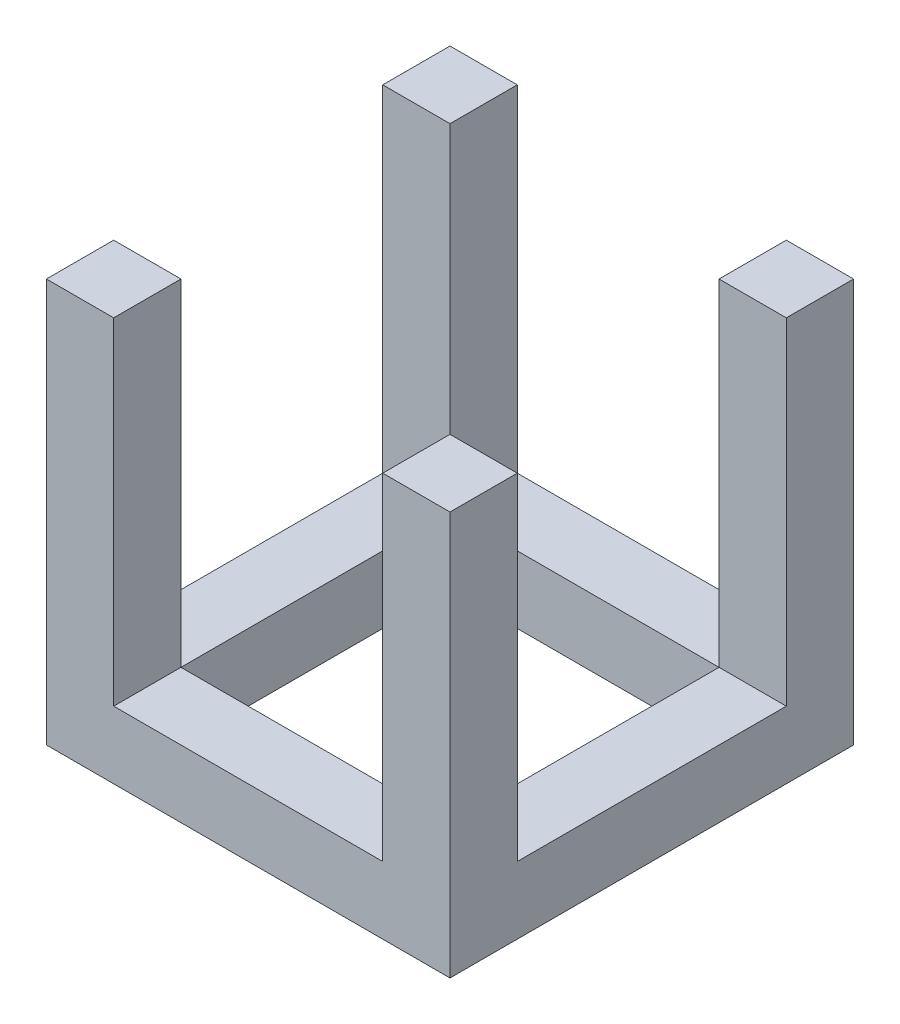
ISO-10303-21;
HEADER;
FILE_DESCRIPTION(('STEP AP214'),'2;1');
FILE_NAME('part.step','',(''),(''),'','','');
FILE_SCHEMA(('AUTOMOTIVE_DESIGN { 1 0 10303 214 1 1 1 1 }'));
ENDSEC;
DATA;
#1=APPLICATION_CONTEXT('core data for automotive mechanical design processes');
#2=APPLICATION_PROTOCOL_DEFINITION('international standard','automotive_design',2000,#1);
#3=PRODUCT_CONTEXT('',#1,'mechanical');
#4=PRODUCT('Part','Part','',(#3));
#5=PRODUCT_RELATED_PRODUCT_CATEGORY('part','',(#4));
#6=PRODUCT_DEFINITION_FORMATION('','',#4);
#7=PRODUCT_DEFINITION_CONTEXT('part definition',#1,'design');
#8=PRODUCT_DEFINITION('design','',#6,#7);
#9=PRODUCT_DEFINITION_SHAPE('','',#8);
#10=(LENGTH_UNIT() NAMED_UNIT(*) SI_UNIT(.MILLI.,.METRE.));
#11=(NAMED_UNIT(*) PLANE_ANGLE_UNIT() SI_UNIT($,.RADIAN.));
#12=(NAMED_UNIT(*) SI_UNIT($,.STERADIAN.) SOLID_ANGLE_UNIT());
#13=UNCERTAINTY_MEASURE_WITH_UNIT(LENGTH_MEASURE(1.E-05),#10,'distance_accuracy_value','');
#14=(GEOMETRIC_REPRESENTATION_CONTEXT(3) GLOBAL_UNCERTAINTY_ASSIGNED_CONTEXT((#13)) GLOBAL_UNIT_ASSIGNED_CONTEXT((#10,
#11,#12)) REPRESENTATION_CONTEXT('',''));
#15=CARTESIAN_POINT('',(0.,0.,0.));
#16=DIRECTION('',(0.,0.,1.));
#17=DIRECTION('',(1.,0.,0.));
#18=AXIS2_PLACEMENT_3D('',#15,#16,#17);
#19=CARTESIAN_POINT('',(0.,30.,0.));
#20=DIRECTION('',(0.,-1.,0.));
#21=DIRECTION('',(0.,0.,-1.));
#22=AXIS2_PLACEMENT_3D('',#19,#20,#21);
#23=PLANE('',#22);
#24=DIRECTION('',(0.,0.,-1.));
#25=VECTOR('',#24,1.);
#26=CARTESIAN_POINT('',(15.,30.,15.));
#27=LINE('',#26,#25);
#28=CARTESIAN_POINT('',(15.,30.,15.));
#29=VERTEX_POINT('',#28);
#30=CARTESIAN_POINT('',(15.,30.,9.99999999999999));
#31=VERTEX_POINT('',#30);
#32=EDGE_CURVE('E188',#29,#31,#27,.T.);
#33=ORIENTED_EDGE('',*,*,#32,.T.);
#34=DIRECTION('',(-1.,0.,0.));
#35=VECTOR('',#34,1.);
#36=CARTESIAN_POINT('',(15.,30.,9.99999999999999));
#37=LINE('',#36,#35);
#38=CARTESIAN_POINT('',(10.,30.,9.99999999999999));
#39=VERTEX_POINT('',#38);
#40=EDGE_CURVE('E265',#31,#39,#37,.T.);
#41=ORIENTED_EDGE('',*,*,#40,.T.);
#42=DIRECTION('',(0.,0.,-1.));
#43=VECTOR('',#42,1.);
#44=CARTESIAN_POINT('',(10.,30.,10.));
#45=LINE('',#44,#43);
#46=CARTESIAN_POINT('',(10.,30.,15.));
#47=VERTEX_POINT('',#46);
#48=EDGE_CURVE('E312',#47,#39,#45,.T.);
#49=ORIENTED_EDGE('',*,*,#48,.F.);
#50=DIRECTION('',(1.,0.,0.));
#51=VECTOR('',#50,1.);
#52=CARTESIAN_POINT('',(-15.,30.,15.));
#53=LINE('',#52,#51);
#54=EDGE_CURVE('E205',#47,#29,#53,.T.);
#55=ORIENTED_EDGE('',*,*,#54,.T.);
#56=EDGE_LOOP('',(#33,#41,#49,#55));
#57=FACE_BOUND('',#56,.T.);
#58=ADVANCED_FACE('F39',(#57),#23,.F.);
#59=DIRECTION('',(0.,0.,1.));
#60=VECTOR('',#59,1.);
#61=CARTESIAN_POINT('',(-10.,30.,10.));
#62=LINE('',#61,#60);
#63=CARTESIAN_POINT('',(-10.,30.,10.));
#64=VERTEX_POINT('',#63);
#65=CARTESIAN_POINT('',(-10.,30.,15.));
#66=VERTEX_POINT('',#65);
#67=EDGE_CURVE('E252',#64,#66,#62,.T.);
#68=ORIENTED_EDGE('',*,*,#67,.F.);
#69=CARTESIAN_POINT('',(-15.,30.,10.));
#70=VERTEX_POINT('',#69);
#71=EDGE_CURVE('E253',#64,#70,#37,.T.);
#72=ORIENTED_EDGE('',*,*,#71,.T.);
#73=DIRECTION('',(0.,0.,1.));
#74=VECTOR('',#73,1.);
#75=CARTESIAN_POINT('',(-15.,30.,15.));
#76=LINE('',#75,#74);
#77=CARTESIAN_POINT('',(-15.,30.,15.));
#78=VERTEX_POINT('',#77);
#79=EDGE_CURVE('E201',#70,#78,#76,.T.);
#80=ORIENTED_EDGE('',*,*,#79,.T.);
#81=EDGE_CURVE('E206',#78,#66,#53,.T.);
#82=ORIENTED_EDGE('',*,*,#81,.T.);
#83=EDGE_LOOP('',(#68,#72,#80,#82));
#84=FACE_BOUND('',#83,.T.);
#85=ADVANCED_FACE('F250',(#84),#23,.F.);
#86=CARTESIAN_POINT('',(10.,30.,10.));
#87=DIRECTION('',(-1.,0.,0.));
#88=DIRECTION('',(0.,0.,1.));
#89=AXIS2_PLACEMENT_3D('',#86,#87,#88);
#90=PLANE('',#89);
#91=DIRECTION('',(0.,1.,0.));
#92=VECTOR('',#91,1.);
#93=CARTESIAN_POINT('',(10.,30.,9.99999999999999));
#94=LINE('',#93,#92);
#95=CARTESIAN_POINT('',(10.,5.00000000000001,9.99999999999999));
#96=VERTEX_POINT('',#95);
#97=EDGE_CURVE('E279',#96,#39,#94,.T.);
#98=ORIENTED_EDGE('',*,*,#97,.F.);
#99=DIRECTION('',(0.,0.,1.));
#100=VECTOR('',#99,1.);
#101=CARTESIAN_POINT('',(10.,5.00000000000001,-15.));
#102=LINE('',#101,#100);
#103=CARTESIAN_POINT('',(10.,5.00000000000001,15.));
#104=VERTEX_POINT('',#103);
#105=EDGE_CURVE('E305',#96,#104,#102,.T.);
#106=ORIENTED_EDGE('',*,*,#105,.T.);
#107=DIRECTION('',(0.,1.,0.));
#108=VECTOR('',#107,1.);
#109=CARTESIAN_POINT('',(10.,30.,15.));
#110=LINE('',#109,#108);
#111=EDGE_CURVE('E290',#104,#47,#110,.T.);
#112=ORIENTED_EDGE('',*,*,#111,.T.);
#113=ORIENTED_EDGE('',*,*,#48,.T.);
#114=EDGE_LOOP('',(#98,#106,#112,#113));
#115=FACE_BOUND('',#114,.T.);
#116=ADVANCED_FACE('F360',(#115),#90,.T.);
#117=DIRECTION('',(0.,0.,1.));
#118=VECTOR('',#117,1.);
#119=CARTESIAN_POINT('',(10.,5.00000000000001,10.));
#120=LINE('',#119,#118);
#121=CARTESIAN_POINT('',(10.,5.,-10.));
#122=VERTEX_POINT('',#121);
#123=EDGE_CURVE('E284',#122,#96,#120,.T.);
#124=ORIENTED_EDGE('',*,*,#123,.F.);
#125=DIRECTION('',(0.,-1.,0.));
#126=VECTOR('',#125,1.);
#127=CARTESIAN_POINT('',(10.,30.,-10.));
#128=LINE('',#127,#126);
#129=CARTESIAN_POINT('',(10.,0.,-10.));
#130=VERTEX_POINT('',#129);
#131=EDGE_CURVE('E197',#122,#130,#128,.T.);
#132=ORIENTED_EDGE('',*,*,#131,.T.);
#133=DIRECTION('',(0.,0.,-1.));
#134=VECTOR('',#133,1.);
#135=CARTESIAN_POINT('',(10.,0.,10.));
#136=LINE('',#135,#134);
#137=CARTESIAN_POINT('',(10.,0.,10.));
#138=VERTEX_POINT('',#137);
#139=EDGE_CURVE('E311',#138,#130,#136,.T.);
#140=ORIENTED_EDGE('',*,*,#139,.F.);
#141=DIRECTION('',(0.,-1.,0.));
#142=VECTOR('',#141,1.);
#143=CARTESIAN_POINT('',(10.,30.,10.));
#144=LINE('',#143,#142);
#145=EDGE_CURVE('E62',#96,#138,#144,.T.);
#146=ORIENTED_EDGE('',*,*,#145,.F.);
#147=EDGE_LOOP('',(#124,#132,#140,#146));
#148=FACE_BOUND('',#147,.T.);
#149=ADVANCED_FACE('F340',(#148),#90,.T.);
#150=CARTESIAN_POINT('',(-10.,30.,10.));
#151=DIRECTION('',(1.,0.,0.));
#152=DIRECTION('',(0.,0.,-1.));
#153=AXIS2_PLACEMENT_3D('',#150,#151,#152);
#154=PLANE('',#153);
#155=DIRECTION('',(0.,-1.,0.));
#156=VECTOR('',#155,1.);
#157=CARTESIAN_POINT('',(-10.,30.,10.));
#158=LINE('',#157,#156);
#159=CARTESIAN_POINT('',(-10.,5.00000000000001,10.));
#160=VERTEX_POINT('',#159);
#161=EDGE_CURVE('E277',#64,#160,#158,.T.);
#162=ORIENTED_EDGE('',*,*,#161,.F.);
#163=ORIENTED_EDGE('',*,*,#67,.T.);
#164=DIRECTION('',(0.,-1.,0.));
#165=VECTOR('',#164,1.);
#166=CARTESIAN_POINT('',(-10.,30.,15.));
#167=LINE('',#166,#165);
#168=CARTESIAN_POINT('',(-10.,5.,15.));
#169=VERTEX_POINT('',#168);
#170=EDGE_CURVE('E247',#66,#169,#167,.T.);
#171=ORIENTED_EDGE('',*,*,#170,.T.);
#172=DIRECTION('',(0.,0.,1.));
#173=VECTOR('',#172,1.);
#174=CARTESIAN_POINT('',(-10.,5.,-15.));
#175=LINE('',#174,#173);
#176=EDGE_CURVE('E294',#160,#169,#175,.T.);
#177=ORIENTED_EDGE('',*,*,#176,.F.);
#178=EDGE_LOOP('',(#162,#163,#171,#177));
#179=FACE_BOUND('',#178,.T.);
#180=ADVANCED_FACE('F353',(#179),#154,.T.);
#181=DIRECTION('',(0.,0.,-1.));
#182=VECTOR('',#181,1.);
#183=CARTESIAN_POINT('',(-10.,5.00000000000001,10.));
#184=LINE('',#183,#182);
#185=CARTESIAN_POINT('',(-10.,5.,-10.));
#186=VERTEX_POINT('',#185);
#187=EDGE_CURVE('E281',#160,#186,#184,.T.);
#188=ORIENTED_EDGE('',*,*,#187,.F.);
#189=DIRECTION('',(0.,-1.,0.));
#190=VECTOR('',#189,1.);
#191=CARTESIAN_POINT('',(-10.,30.,10.));
#192=LINE('',#191,#190);
#193=CARTESIAN_POINT('',(-10.,0.,10.));
#194=VERTEX_POINT('',#193);
#195=EDGE_CURVE('E330',#160,#194,#192,.T.);
#196=ORIENTED_EDGE('',*,*,#195,.T.);
#197=DIRECTION('',(0.,0.,1.));
#198=VECTOR('',#197,1.);
#199=CARTESIAN_POINT('',(-10.,0.,10.));
#200=LINE('',#199,#198);
#201=CARTESIAN_POINT('',(-10.,0.,-10.));
#202=VERTEX_POINT('',#201);
#203=EDGE_CURVE('E323',#202,#194,#200,.T.);
#204=ORIENTED_EDGE('',*,*,#203,.F.);
#205=DIRECTION('',(0.,-1.,0.));
#206=VECTOR('',#205,1.);
#207=CARTESIAN_POINT('',(-10.,30.,-10.));
#208=LINE('',#207,#206);
#209=EDGE_CURVE('E331',#186,#202,#208,.T.);
#210=ORIENTED_EDGE('',*,*,#209,.F.);
#211=EDGE_LOOP('',(#188,#196,#204,#210));
#212=FACE_BOUND('',#211,.T.);
#213=ADVANCED_FACE('F346',(#212),#154,.T.);
#214=CARTESIAN_POINT('',(10.,30.,-10.));
#215=VERTEX_POINT('',#214);
#216=CARTESIAN_POINT('',(10.,30.,-15.));
#217=VERTEX_POINT('',#216);
#218=EDGE_CURVE('E181',#215,#217,#45,.T.);
#219=ORIENTED_EDGE('',*,*,#218,.F.);
#220=DIRECTION('',(-1.,0.,0.));
#221=VECTOR('',#220,1.);
#222=CARTESIAN_POINT('',(15.,30.,-10.));
#223=LINE('',#222,#221);
#224=CARTESIAN_POINT('',(15.,30.,-10.));
#225=VERTEX_POINT('',#224);
#226=EDGE_CURVE('E54',#225,#215,#223,.T.);
#227=ORIENTED_EDGE('',*,*,#226,.F.);
#228=CARTESIAN_POINT('',(15.,30.,-15.));
#229=VERTEX_POINT('',#228);
#230=EDGE_CURVE('E179',#225,#229,#27,.T.);
#231=ORIENTED_EDGE('',*,*,#230,.T.);
#232=DIRECTION('',(-1.,0.,0.));
#233=VECTOR('',#232,1.);
#234=CARTESIAN_POINT('',(-15.,30.,-15.));
#235=LINE('',#234,#233);
#236=EDGE_CURVE('E199',#229,#217,#235,.T.);
#237=ORIENTED_EDGE('',*,*,#236,.T.);
#238=EDGE_LOOP('',(#219,#227,#231,#237));
#239=FACE_BOUND('',#238,.T.);
#240=ADVANCED_FACE('F177',(#239),#23,.F.);
#241=CARTESIAN_POINT('',(-15.,30.,-15.));
#242=VERTEX_POINT('',#241);
#243=CARTESIAN_POINT('',(-15.,30.,-10.));
#244=VERTEX_POINT('',#243);
#245=EDGE_CURVE('E202',#242,#244,#76,.T.);
#246=ORIENTED_EDGE('',*,*,#245,.T.);
#247=CARTESIAN_POINT('',(-10.,30.,-10.));
#248=VERTEX_POINT('',#247);
#249=EDGE_CURVE('E183',#248,#244,#223,.T.);
#250=ORIENTED_EDGE('',*,*,#249,.F.);
#251=CARTESIAN_POINT('',(-10.,30.,-15.));
#252=VERTEX_POINT('',#251);
#253=EDGE_CURVE('E315',#252,#248,#62,.T.);
#254=ORIENTED_EDGE('',*,*,#253,.F.);
#255=EDGE_CURVE('E192',#252,#242,#235,.T.);
#256=ORIENTED_EDGE('',*,*,#255,.T.);
#257=EDGE_LOOP('',(#246,#250,#254,#256));
#258=FACE_BOUND('',#257,.T.);
#259=ADVANCED_FACE('F374',(#258),#23,.F.);
#260=CARTESIAN_POINT('',(0.,0.,0.));
#261=DIRECTION('',(0.,-1.,0.));
#262=DIRECTION('',(0.,0.,-1.));
#263=AXIS2_PLACEMENT_3D('',#260,#261,#262);
#264=PLANE('',#263);
#265=DIRECTION('',(0.,0.,-1.));
#266=VECTOR('',#265,1.);
#267=CARTESIAN_POINT('',(15.,0.,15.));
#268=LINE('',#267,#266);
#269=CARTESIAN_POINT('',(15.,0.,15.));
#270=VERTEX_POINT('',#269);
#271=CARTESIAN_POINT('',(15.,0.,-15.));
#272=VERTEX_POINT('',#271);
#273=EDGE_CURVE('E210',#270,#272,#268,.T.);
#274=ORIENTED_EDGE('',*,*,#273,.F.);
#275=DIRECTION('',(1.,0.,0.));
#276=VECTOR('',#275,1.);
#277=CARTESIAN_POINT('',(-15.,0.,15.));
#278=LINE('',#277,#276);
#279=CARTESIAN_POINT('',(-15.,0.,15.));
#280=VERTEX_POINT('',#279);
#281=EDGE_CURVE('E189',#280,#270,#278,.T.);
#282=ORIENTED_EDGE('',*,*,#281,.F.);
#283=DIRECTION('',(0.,0.,1.));
#284=VECTOR('',#283,1.);
#285=CARTESIAN_POINT('',(-15.,0.,15.));
#286=LINE('',#285,#284);
#287=CARTESIAN_POINT('',(-15.,0.,-15.));
#288=VERTEX_POINT('',#287);
#289=EDGE_CURVE('E193',#288,#280,#286,.T.);
#290=ORIENTED_EDGE('',*,*,#289,.F.);
#291=DIRECTION('',(-1.,0.,0.));
#292=VECTOR('',#291,1.);
#293=CARTESIAN_POINT('',(-15.,0.,-15.));
#294=LINE('',#293,#292);
#295=EDGE_CURVE('E212',#272,#288,#294,.T.);
#296=ORIENTED_EDGE('',*,*,#295,.F.);
#297=EDGE_LOOP('',(#274,#282,#290,#296));
#298=FACE_BOUND('',#297,.T.);
#299=DIRECTION('',(1.,0.,0.));
#300=VECTOR('',#299,1.);
#301=CARTESIAN_POINT('',(-10.,0.,10.));
#302=LINE('',#301,#300);
#303=EDGE_CURVE('E326',#194,#138,#302,.T.);
#304=ORIENTED_EDGE('',*,*,#303,.T.);
#305=ORIENTED_EDGE('',*,*,#139,.T.);
#306=DIRECTION('',(-1.,0.,0.));
#307=VECTOR('',#306,1.);
#308=CARTESIAN_POINT('',(-10.,0.,-10.));
#309=LINE('',#308,#307);
#310=EDGE_CURVE('E320',#130,#202,#309,.T.);
#311=ORIENTED_EDGE('',*,*,#310,.T.);
#312=ORIENTED_EDGE('',*,*,#203,.T.);
#313=EDGE_LOOP('',(#304,#305,#311,#312));
#314=FACE_BOUND('',#313,.T.);
#315=ADVANCED_FACE('F232',(#298,#314),#264,.T.);
#316=CARTESIAN_POINT('',(15.,30.,15.));
#317=DIRECTION('',(-1.,0.,0.));
#318=DIRECTION('',(0.,0.,1.));
#319=AXIS2_PLACEMENT_3D('',#316,#317,#318);
#320=PLANE('',#319);
#321=DIRECTION('',(0.,0.,1.));
#322=VECTOR('',#321,1.);
#323=CARTESIAN_POINT('',(15.,5.,-10.));
#324=LINE('',#323,#322);
#325=CARTESIAN_POINT('',(15.,5.,-10.));
#326=VERTEX_POINT('',#325);
#327=CARTESIAN_POINT('',(15.,5.00000000000001,9.99999999999999));
#328=VERTEX_POINT('',#327);
#329=EDGE_CURVE('E172',#326,#328,#324,.T.);
#330=ORIENTED_EDGE('',*,*,#329,.T.);
#331=DIRECTION('',(0.,1.,0.));
#332=VECTOR('',#331,1.);
#333=CARTESIAN_POINT('',(15.,30.,9.99999999999999));
#334=LINE('',#333,#332);
#335=EDGE_CURVE('E366',#328,#31,#334,.T.);
#336=ORIENTED_EDGE('',*,*,#335,.T.);
#337=ORIENTED_EDGE('',*,*,#32,.F.);
#338=DIRECTION('',(0.,-1.,0.));
#339=VECTOR('',#338,1.);
#340=CARTESIAN_POINT('',(15.,30.,15.));
#341=LINE('',#340,#339);
#342=EDGE_CURVE('E209',#29,#270,#341,.T.);
#343=ORIENTED_EDGE('',*,*,#342,.T.);
#344=ORIENTED_EDGE('',*,*,#273,.T.);
#345=DIRECTION('',(0.,-1.,0.));
#346=VECTOR('',#345,1.);
#347=CARTESIAN_POINT('',(15.,30.,-15.));
#348=LINE('',#347,#346);
#349=EDGE_CURVE('E47',#229,#272,#348,.T.);
#350=ORIENTED_EDGE('',*,*,#349,.F.);
#351=ORIENTED_EDGE('',*,*,#230,.F.);
#352=DIRECTION('',(0.,-1.,0.));
#353=VECTOR('',#352,1.);
#354=CARTESIAN_POINT('',(15.,30.,-10.));
#355=LINE('',#354,#353);
#356=EDGE_CURVE('E164',#225,#326,#355,.T.);
#357=ORIENTED_EDGE('',*,*,#356,.T.);
#358=EDGE_LOOP('',(#330,#336,#337,#343,#344,#350,#351,#357));
#359=FACE_BOUND('',#358,.T.);
#360=ADVANCED_FACE('F41',(#359),#320,.F.);
#361=CARTESIAN_POINT('',(-15.,30.,-15.));
#362=DIRECTION('',(0.,0.,1.));
#363=DIRECTION('',(1.,0.,0.));
#364=AXIS2_PLACEMENT_3D('',#361,#362,#363);
#365=PLANE('',#364);
#366=DIRECTION('',(1.,0.,0.));
#367=VECTOR('',#366,1.);
#368=CARTESIAN_POINT('',(-10.,5.,-15.));
#369=LINE('',#368,#367);
#370=CARTESIAN_POINT('',(-10.,5.,-15.));
#371=VERTEX_POINT('',#370);
#372=CARTESIAN_POINT('',(10.,5.00000000000001,-15.));
#373=VERTEX_POINT('',#372);
#374=EDGE_CURVE('E289',#371,#373,#369,.T.);
#375=ORIENTED_EDGE('',*,*,#374,.T.);
#376=DIRECTION('',(0.,1.,0.));
#377=VECTOR('',#376,1.);
#378=CARTESIAN_POINT('',(10.,30.,-15.));
#379=LINE('',#378,#377);
#380=EDGE_CURVE('E292',#373,#217,#379,.T.);
#381=ORIENTED_EDGE('',*,*,#380,.T.);
#382=ORIENTED_EDGE('',*,*,#236,.F.);
#383=ORIENTED_EDGE('',*,*,#349,.T.);
#384=ORIENTED_EDGE('',*,*,#295,.T.);
#385=DIRECTION('',(0.,-1.,0.));
#386=VECTOR('',#385,1.);
#387=CARTESIAN_POINT('',(-15.,30.,-15.));
#388=LINE('',#387,#386);
#389=EDGE_CURVE('E220',#242,#288,#388,.T.);
#390=ORIENTED_EDGE('',*,*,#389,.F.);
#391=ORIENTED_EDGE('',*,*,#255,.F.);
#392=DIRECTION('',(0.,-1.,0.));
#393=VECTOR('',#392,1.);
#394=CARTESIAN_POINT('',(-10.,30.,-15.));
#395=LINE('',#394,#393);
#396=EDGE_CURVE('E286',#252,#371,#395,.T.);
#397=ORIENTED_EDGE('',*,*,#396,.T.);
#398=EDGE_LOOP('',(#375,#381,#382,#383,#384,#390,#391,#397));
#399=FACE_BOUND('',#398,.T.);
#400=ADVANCED_FACE('F224',(#399),#365,.F.);
#401=CARTESIAN_POINT('',(-15.,30.,15.));
#402=DIRECTION('',(1.,0.,0.));
#403=DIRECTION('',(0.,0.,-1.));
#404=AXIS2_PLACEMENT_3D('',#401,#402,#403);
#405=PLANE('',#404);
#406=ORIENTED_EDGE('',*,*,#79,.F.);
#407=DIRECTION('',(0.,1.,0.));
#408=VECTOR('',#407,1.);
#409=CARTESIAN_POINT('',(-15.,30.,10.));
#410=LINE('',#409,#408);
#411=CARTESIAN_POINT('',(-15.,5.00000000000001,10.));
#412=VERTEX_POINT('',#411);
#413=EDGE_CURVE('E173',#412,#70,#410,.T.);
#414=ORIENTED_EDGE('',*,*,#413,.F.);
#415=DIRECTION('',(0.,0.,1.));
#416=VECTOR('',#415,1.);
#417=CARTESIAN_POINT('',(-15.,5.,-10.));
#418=LINE('',#417,#416);
#419=CARTESIAN_POINT('',(-15.,5.,-10.));
#420=VERTEX_POINT('',#419);
#421=EDGE_CURVE('E258',#420,#412,#418,.T.);
#422=ORIENTED_EDGE('',*,*,#421,.F.);
#423=DIRECTION('',(0.,-1.,0.));
#424=VECTOR('',#423,1.);
#425=CARTESIAN_POINT('',(-15.,30.,-10.));
#426=LINE('',#425,#424);
#427=EDGE_CURVE('E261',#244,#420,#426,.T.);
#428=ORIENTED_EDGE('',*,*,#427,.F.);
#429=ORIENTED_EDGE('',*,*,#245,.F.);
#430=ORIENTED_EDGE('',*,*,#389,.T.);
#431=ORIENTED_EDGE('',*,*,#289,.T.);
#432=DIRECTION('',(0.,-1.,0.));
#433=VECTOR('',#432,1.);
#434=CARTESIAN_POINT('',(-15.,30.,15.));
#435=LINE('',#434,#433);
#436=EDGE_CURVE('E217',#78,#280,#435,.T.);
#437=ORIENTED_EDGE('',*,*,#436,.F.);
#438=EDGE_LOOP('',(#406,#414,#422,#428,#429,#430,#431,#437));
#439=FACE_BOUND('',#438,.T.);
#440=ADVANCED_FACE('F238',(#439),#405,.F.);
#441=CARTESIAN_POINT('',(-15.,30.,15.));
#442=DIRECTION('',(0.,0.,-1.));
#443=DIRECTION('',(-1.,0.,0.));
#444=AXIS2_PLACEMENT_3D('',#441,#442,#443);
#445=PLANE('',#444);
#446=ORIENTED_EDGE('',*,*,#54,.F.);
#447=ORIENTED_EDGE('',*,*,#111,.F.);
#448=DIRECTION('',(1.,0.,0.));
#449=VECTOR('',#448,1.);
#450=CARTESIAN_POINT('',(-10.,5.,15.));
#451=LINE('',#450,#449);
#452=EDGE_CURVE('E296',#169,#104,#451,.T.);
#453=ORIENTED_EDGE('',*,*,#452,.F.);
#454=ORIENTED_EDGE('',*,*,#170,.F.);
#455=ORIENTED_EDGE('',*,*,#81,.F.);
#456=ORIENTED_EDGE('',*,*,#436,.T.);
#457=ORIENTED_EDGE('',*,*,#281,.T.);
#458=ORIENTED_EDGE('',*,*,#342,.F.);
#459=EDGE_LOOP('',(#446,#447,#453,#454,#455,#456,#457,#458));
#460=FACE_BOUND('',#459,.T.);
#461=ADVANCED_FACE('F243',(#460),#445,.F.);
#462=DIRECTION('',(0.,-1.,0.));
#463=VECTOR('',#462,1.);
#464=CARTESIAN_POINT('',(10.,30.,-10.));
#465=LINE('',#464,#463);
#466=EDGE_CURVE('E275',#215,#122,#465,.T.);
#467=ORIENTED_EDGE('',*,*,#466,.F.);
#468=ORIENTED_EDGE('',*,*,#218,.T.);
#469=ORIENTED_EDGE('',*,*,#380,.F.);
#470=EDGE_CURVE('E301',#373,#122,#102,.T.);
#471=ORIENTED_EDGE('',*,*,#470,.T.);
#472=EDGE_LOOP('',(#467,#468,#469,#471));
#473=FACE_BOUND('',#472,.T.);
#474=ADVANCED_FACE('F384',(#473),#90,.T.);
#475=CARTESIAN_POINT('',(-10.,30.,-10.));
#476=DIRECTION('',(0.,0.,1.));
#477=DIRECTION('',(1.,0.,0.));
#478=AXIS2_PLACEMENT_3D('',#475,#476,#477);
#479=PLANE('',#478);
#480=DIRECTION('',(1.,0.,0.));
#481=VECTOR('',#480,1.);
#482=CARTESIAN_POINT('',(-9.99999999999999,5.,-10.));
#483=LINE('',#482,#481);
#484=EDGE_CURVE('E304',#186,#122,#483,.T.);
#485=ORIENTED_EDGE('',*,*,#484,.F.);
#486=ORIENTED_EDGE('',*,*,#209,.T.);
#487=ORIENTED_EDGE('',*,*,#310,.F.);
#488=ORIENTED_EDGE('',*,*,#131,.F.);
#489=EDGE_LOOP('',(#485,#486,#487,#488));
#490=FACE_BOUND('',#489,.T.);
#491=ADVANCED_FACE('F341',(#490),#479,.T.);
#492=DIRECTION('',(0.,1.,0.));
#493=VECTOR('',#492,1.);
#494=CARTESIAN_POINT('',(-10.,30.,-10.));
#495=LINE('',#494,#493);
#496=EDGE_CURVE('E268',#186,#248,#495,.T.);
#497=ORIENTED_EDGE('',*,*,#496,.F.);
#498=EDGE_CURVE('E306',#371,#186,#175,.T.);
#499=ORIENTED_EDGE('',*,*,#498,.F.);
#500=ORIENTED_EDGE('',*,*,#396,.F.);
#501=ORIENTED_EDGE('',*,*,#253,.T.);
#502=EDGE_LOOP('',(#497,#499,#500,#501));
#503=FACE_BOUND('',#502,.T.);
#504=ADVANCED_FACE('F379',(#503),#154,.T.);
#505=CARTESIAN_POINT('',(-10.,30.,10.));
#506=DIRECTION('',(0.,0.,-1.));
#507=DIRECTION('',(-1.,0.,0.));
#508=AXIS2_PLACEMENT_3D('',#505,#506,#507);
#509=PLANE('',#508);
#510=DIRECTION('',(-1.,0.,0.));
#511=VECTOR('',#510,1.);
#512=CARTESIAN_POINT('',(-9.99999999999999,5.,10.));
#513=LINE('',#512,#511);
#514=EDGE_CURVE('E11',#96,#160,#513,.T.);
#515=ORIENTED_EDGE('',*,*,#514,.F.);
#516=ORIENTED_EDGE('',*,*,#145,.T.);
#517=ORIENTED_EDGE('',*,*,#303,.F.);
#518=ORIENTED_EDGE('',*,*,#195,.F.);
#519=EDGE_LOOP('',(#515,#516,#517,#518));
#520=FACE_BOUND('',#519,.T.);
#521=ADVANCED_FACE('F343',(#520),#509,.T.);
#522=CARTESIAN_POINT('',(-10.,5.,-15.));
#523=DIRECTION('',(0.,-1.,0.));
#524=DIRECTION('',(1.,0.,0.));
#525=AXIS2_PLACEMENT_3D('',#522,#523,#524);
#526=PLANE('',#525);
#527=ORIENTED_EDGE('',*,*,#514,.T.);
#528=ORIENTED_EDGE('',*,*,#176,.T.);
#529=ORIENTED_EDGE('',*,*,#452,.T.);
#530=ORIENTED_EDGE('',*,*,#105,.F.);
#531=EDGE_LOOP('',(#527,#528,#529,#530));
#532=FACE_BOUND('',#531,.T.);
#533=ADVANCED_FACE('F356',(#532),#526,.F.);
#534=ORIENTED_EDGE('',*,*,#484,.T.);
#535=ORIENTED_EDGE('',*,*,#470,.F.);
#536=ORIENTED_EDGE('',*,*,#374,.F.);
#537=ORIENTED_EDGE('',*,*,#498,.T.);
#538=EDGE_LOOP('',(#534,#535,#536,#537));
#539=FACE_BOUND('',#538,.T.);
#540=ADVANCED_FACE('F381',(#539),#526,.F.);
#541=CARTESIAN_POINT('',(15.,30.,-10.));
#542=DIRECTION('',(0.,0.,-1.));
#543=DIRECTION('',(-1.,0.,0.));
#544=AXIS2_PLACEMENT_3D('',#541,#542,#543);
#545=PLANE('',#544);
#546=ORIENTED_EDGE('',*,*,#496,.T.);
#547=ORIENTED_EDGE('',*,*,#249,.T.);
#548=ORIENTED_EDGE('',*,*,#427,.T.);
#549=DIRECTION('',(-1.,0.,0.));
#550=VECTOR('',#549,1.);
#551=CARTESIAN_POINT('',(15.,5.,-10.));
#552=LINE('',#551,#550);
#553=EDGE_CURVE('E182',#186,#420,#552,.T.);
#554=ORIENTED_EDGE('',*,*,#553,.F.);
#555=EDGE_LOOP('',(#546,#547,#548,#554));
#556=FACE_BOUND('',#555,.T.);
#557=ADVANCED_FACE('F371',(#556),#545,.F.);
#558=CARTESIAN_POINT('',(15.,5.,-10.));
#559=DIRECTION('',(0.,-1.,0.));
#560=DIRECTION('',(0.,0.,-1.));
#561=AXIS2_PLACEMENT_3D('',#558,#559,#560);
#562=PLANE('',#561);
#563=ORIENTED_EDGE('',*,*,#187,.T.);
#564=ORIENTED_EDGE('',*,*,#553,.T.);
#565=ORIENTED_EDGE('',*,*,#421,.T.);
#566=DIRECTION('',(-1.,0.,0.));
#567=VECTOR('',#566,1.);
#568=CARTESIAN_POINT('',(15.,5.00000000000001,9.99999999999999));
#569=LINE('',#568,#567);
#570=EDGE_CURVE('E272',#160,#412,#569,.T.);
#571=ORIENTED_EDGE('',*,*,#570,.F.);
#572=EDGE_LOOP('',(#563,#564,#565,#571));
#573=FACE_BOUND('',#572,.T.);
#574=ADVANCED_FACE('F390',(#573),#562,.F.);
#575=CARTESIAN_POINT('',(15.,30.,9.99999999999999));
#576=DIRECTION('',(0.,0.,1.));
#577=DIRECTION('',(1.,0.,0.));
#578=AXIS2_PLACEMENT_3D('',#575,#576,#577);
#579=PLANE('',#578);
#580=ORIENTED_EDGE('',*,*,#161,.T.);
#581=ORIENTED_EDGE('',*,*,#570,.T.);
#582=ORIENTED_EDGE('',*,*,#413,.T.);
#583=ORIENTED_EDGE('',*,*,#71,.F.);
#584=EDGE_LOOP('',(#580,#581,#582,#583));
#585=FACE_BOUND('',#584,.T.);
#586=ADVANCED_FACE('F388',(#585),#579,.F.);
#587=ORIENTED_EDGE('',*,*,#123,.T.);
#588=EDGE_CURVE('E269',#328,#96,#569,.T.);
#589=ORIENTED_EDGE('',*,*,#588,.F.);
#590=ORIENTED_EDGE('',*,*,#329,.F.);
#591=EDGE_CURVE('E167',#326,#122,#552,.T.);
#592=ORIENTED_EDGE('',*,*,#591,.T.);
#593=EDGE_LOOP('',(#587,#589,#590,#592));
#594=FACE_BOUND('',#593,.T.);
#595=ADVANCED_FACE('F386',(#594),#562,.F.);
#596=ORIENTED_EDGE('',*,*,#97,.T.);
#597=ORIENTED_EDGE('',*,*,#40,.F.);
#598=ORIENTED_EDGE('',*,*,#335,.F.);
#599=ORIENTED_EDGE('',*,*,#588,.T.);
#600=EDGE_LOOP('',(#596,#597,#598,#599));
#601=FACE_BOUND('',#600,.T.);
#602=ADVANCED_FACE('F362',(#601),#579,.F.);
#603=ORIENTED_EDGE('',*,*,#466,.T.);
#604=ORIENTED_EDGE('',*,*,#591,.F.);
#605=ORIENTED_EDGE('',*,*,#356,.F.);
#606=ORIENTED_EDGE('',*,*,#226,.T.);
#607=EDGE_LOOP('',(#603,#604,#605,#606));
#608=FACE_BOUND('',#607,.T.);
#609=ADVANCED_FACE('F165',(#608),#545,.F.);
#610=CLOSED_SHELL('',(#58,#85,#116,#149,#180,#213,#240,#259,#315,#360,#400,#440,#461,#474,#491,
#504,#521,#533,#540,#557,#574,#586,#595,#602,#609));
#611=MANIFOLD_SOLID_BREP('B2',#610);
#612=ADVANCED_BREP_SHAPE_REPRESENTATION('',(#18,#611),#14);
#613=SHAPE_DEFINITION_REPRESENTATION(#9,#612);
ENDSEC;
END-ISO-10303-21;
